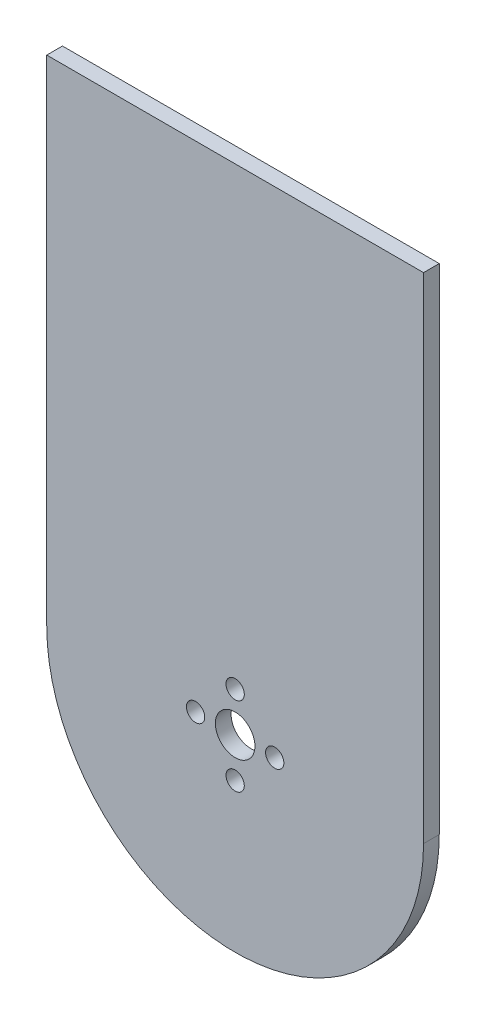
ISO-10303-21;
HEADER;
FILE_DESCRIPTION(('STEP AP214'),'2;1');
FILE_NAME('part.step','',(''),(''),'','','');
FILE_SCHEMA(('AUTOMOTIVE_DESIGN { 1 0 10303 214 1 1 1 1 }'));
ENDSEC;
DATA;
#1=APPLICATION_CONTEXT('core data for automotive mechanical design processes');
#2=APPLICATION_PROTOCOL_DEFINITION('international standard','automotive_design',2000,#1);
#3=PRODUCT_CONTEXT('',#1,'mechanical');
#4=PRODUCT('Part','Part','',(#3));
#5=PRODUCT_RELATED_PRODUCT_CATEGORY('part','',(#4));
#6=PRODUCT_DEFINITION_FORMATION('','',#4);
#7=PRODUCT_DEFINITION_CONTEXT('part definition',#1,'design');
#8=PRODUCT_DEFINITION('design','',#6,#7);
#9=PRODUCT_DEFINITION_SHAPE('','',#8);
#10=(LENGTH_UNIT() NAMED_UNIT(*) SI_UNIT(.MILLI.,.METRE.));
#11=(NAMED_UNIT(*) PLANE_ANGLE_UNIT() SI_UNIT($,.RADIAN.));
#12=(NAMED_UNIT(*) SI_UNIT($,.STERADIAN.) SOLID_ANGLE_UNIT());
#13=UNCERTAINTY_MEASURE_WITH_UNIT(LENGTH_MEASURE(1.E-05),#10,'distance_accuracy_value','');
#14=(GEOMETRIC_REPRESENTATION_CONTEXT(3) GLOBAL_UNCERTAINTY_ASSIGNED_CONTEXT((#13)) GLOBAL_UNIT_ASSIGNED_CONTEXT((#10,
#11,#12)) REPRESENTATION_CONTEXT('',''));
#15=CARTESIAN_POINT('',(0.,0.,0.));
#16=DIRECTION('',(0.,0.,1.));
#17=DIRECTION('',(1.,0.,0.));
#18=AXIS2_PLACEMENT_3D('',#15,#16,#17);
#19=CARTESIAN_POINT('',(0.,0.,3.175));
#20=DIRECTION('',(0.,0.,1.));
#21=DIRECTION('',(1.,0.,0.));
#22=AXIS2_PLACEMENT_3D('',#19,#20,#21);
#23=PLANE('',#22);
#24=CARTESIAN_POINT('',(0.,8.,3.175));
#25=DIRECTION('',(0.,0.,1.));
#26=DIRECTION('',(1.,0.,0.));
#27=AXIS2_PLACEMENT_3D('',#24,#25,#26);
#28=CIRCLE('',#27,1.85);
#29=CARTESIAN_POINT('',(1.85,8.,3.175));
#30=VERTEX_POINT('',#29);
#31=EDGE_CURVE('E127',#30,#30,#28,.T.);
#32=ORIENTED_EDGE('',*,*,#31,.F.);
#33=EDGE_LOOP('',(#32));
#34=FACE_BOUND('',#33,.T.);
#35=CARTESIAN_POINT('',(-8.,0.,3.175));
#36=DIRECTION('',(0.,0.,1.));
#37=DIRECTION('',(1.,0.,0.));
#38=AXIS2_PLACEMENT_3D('',#35,#36,#37);
#39=CIRCLE('',#38,1.85);
#40=CARTESIAN_POINT('',(-6.15,0.,3.175));
#41=VERTEX_POINT('',#40);
#42=EDGE_CURVE('E115',#41,#41,#39,.T.);
#43=ORIENTED_EDGE('',*,*,#42,.F.);
#44=EDGE_LOOP('',(#43));
#45=FACE_BOUND('',#44,.T.);
#46=DIRECTION('',(0.,-1.,0.));
#47=VECTOR('',#46,1.);
#48=CARTESIAN_POINT('',(-38.1,100.,3.175));
#49=LINE('',#48,#47);
#50=CARTESIAN_POINT('',(-38.1,100.,3.175));
#51=VERTEX_POINT('',#50);
#52=CARTESIAN_POINT('',(-38.1,0.,3.175));
#53=VERTEX_POINT('',#52);
#54=EDGE_CURVE('E85',#51,#53,#49,.T.);
#55=ORIENTED_EDGE('',*,*,#54,.T.);
#56=CARTESIAN_POINT('',(0.,0.,3.175));
#57=DIRECTION('',(0.,0.,1.));
#58=DIRECTION('',(1.,0.,0.));
#59=AXIS2_PLACEMENT_3D('',#56,#57,#58);
#60=CIRCLE('',#59,38.1);
#61=CARTESIAN_POINT('',(38.1,0.,3.175));
#62=VERTEX_POINT('',#61);
#63=EDGE_CURVE('E80',#53,#62,#60,.T.);
#64=ORIENTED_EDGE('',*,*,#63,.T.);
#65=DIRECTION('',(0.,1.,0.));
#66=VECTOR('',#65,1.);
#67=CARTESIAN_POINT('',(38.1,100.,3.175));
#68=LINE('',#67,#66);
#69=CARTESIAN_POINT('',(38.1,100.,3.175));
#70=VERTEX_POINT('',#69);
#71=EDGE_CURVE('E83',#62,#70,#68,.T.);
#72=ORIENTED_EDGE('',*,*,#71,.T.);
#73=DIRECTION('',(-1.,0.,0.));
#74=VECTOR('',#73,1.);
#75=CARTESIAN_POINT('',(-38.1,100.,3.175));
#76=LINE('',#75,#74);
#77=EDGE_CURVE('E50',#70,#51,#76,.T.);
#78=ORIENTED_EDGE('',*,*,#77,.T.);
#79=EDGE_LOOP('',(#55,#64,#72,#78));
#80=FACE_BOUND('',#79,.T.);
#81=CARTESIAN_POINT('',(0.,0.,3.175));
#82=DIRECTION('',(0.,0.,1.));
#83=DIRECTION('',(1.,0.,0.));
#84=AXIS2_PLACEMENT_3D('',#81,#82,#83);
#85=CIRCLE('',#84,4.);
#86=CARTESIAN_POINT('',(4.00000000000001,0.,3.175));
#87=VERTEX_POINT('',#86);
#88=EDGE_CURVE('E100',#87,#87,#85,.T.);
#89=ORIENTED_EDGE('',*,*,#88,.F.);
#90=EDGE_LOOP('',(#89));
#91=FACE_BOUND('',#90,.T.);
#92=CARTESIAN_POINT('',(0.,-8.,3.175));
#93=DIRECTION('',(0.,0.,1.));
#94=DIRECTION('',(1.,0.,0.));
#95=AXIS2_PLACEMENT_3D('',#92,#93,#94);
#96=CIRCLE('',#95,1.85);
#97=CARTESIAN_POINT('',(1.85,-8.,3.175));
#98=VERTEX_POINT('',#97);
#99=EDGE_CURVE('E121',#98,#98,#96,.T.);
#100=ORIENTED_EDGE('',*,*,#99,.F.);
#101=EDGE_LOOP('',(#100));
#102=FACE_BOUND('',#101,.T.);
#103=CARTESIAN_POINT('',(8.,0.,3.175));
#104=DIRECTION('',(0.,0.,1.));
#105=DIRECTION('',(1.,0.,0.));
#106=AXIS2_PLACEMENT_3D('',#103,#104,#105);
#107=CIRCLE('',#106,1.85);
#108=CARTESIAN_POINT('',(9.85,0.,3.175));
#109=VERTEX_POINT('',#108);
#110=EDGE_CURVE('E133',#109,#109,#107,.T.);
#111=ORIENTED_EDGE('',*,*,#110,.F.);
#112=EDGE_LOOP('',(#111));
#113=FACE_BOUND('',#112,.T.);
#114=ADVANCED_FACE('F33',(#34,#45,#80,#91,#102,#113),#23,.T.);
#115=CARTESIAN_POINT('',(0.,0.,0.));
#116=DIRECTION('',(0.,0.,1.));
#117=DIRECTION('',(1.,0.,0.));
#118=AXIS2_PLACEMENT_3D('',#115,#116,#117);
#119=PLANE('',#118);
#120=DIRECTION('',(0.,-1.,0.));
#121=VECTOR('',#120,1.);
#122=CARTESIAN_POINT('',(-38.1,100.,0.));
#123=LINE('',#122,#121);
#124=CARTESIAN_POINT('',(-38.1,100.,0.));
#125=VERTEX_POINT('',#124);
#126=CARTESIAN_POINT('',(-38.1,0.,0.));
#127=VERTEX_POINT('',#126);
#128=EDGE_CURVE('E97',#125,#127,#123,.T.);
#129=ORIENTED_EDGE('',*,*,#128,.F.);
#130=DIRECTION('',(-1.,0.,0.));
#131=VECTOR('',#130,1.);
#132=CARTESIAN_POINT('',(-38.1,100.,0.));
#133=LINE('',#132,#131);
#134=CARTESIAN_POINT('',(38.1,100.,0.));
#135=VERTEX_POINT('',#134);
#136=EDGE_CURVE('E73',#135,#125,#133,.T.);
#137=ORIENTED_EDGE('',*,*,#136,.F.);
#138=DIRECTION('',(0.,1.,0.));
#139=VECTOR('',#138,1.);
#140=CARTESIAN_POINT('',(38.1,100.,0.));
#141=LINE('',#140,#139);
#142=CARTESIAN_POINT('',(38.1,0.,0.));
#143=VERTEX_POINT('',#142);
#144=EDGE_CURVE('E67',#143,#135,#141,.T.);
#145=ORIENTED_EDGE('',*,*,#144,.F.);
#146=CARTESIAN_POINT('',(0.,0.,0.));
#147=DIRECTION('',(0.,0.,1.));
#148=DIRECTION('',(1.,0.,0.));
#149=AXIS2_PLACEMENT_3D('',#146,#147,#148);
#150=CIRCLE('',#149,38.1);
#151=EDGE_CURVE('E89',#127,#143,#150,.T.);
#152=ORIENTED_EDGE('',*,*,#151,.F.);
#153=EDGE_LOOP('',(#129,#137,#145,#152));
#154=FACE_BOUND('',#153,.T.);
#155=CARTESIAN_POINT('',(0.,0.,0.));
#156=DIRECTION('',(0.,0.,1.));
#157=DIRECTION('',(1.,0.,0.));
#158=AXIS2_PLACEMENT_3D('',#155,#156,#157);
#159=CIRCLE('',#158,4.);
#160=CARTESIAN_POINT('',(4.00000000000001,0.,0.));
#161=VERTEX_POINT('',#160);
#162=EDGE_CURVE('E112',#161,#161,#159,.T.);
#163=ORIENTED_EDGE('',*,*,#162,.T.);
#164=EDGE_LOOP('',(#163));
#165=FACE_BOUND('',#164,.T.);
#166=CARTESIAN_POINT('',(-8.,0.,0.));
#167=DIRECTION('',(0.,0.,1.));
#168=DIRECTION('',(1.,0.,0.));
#169=AXIS2_PLACEMENT_3D('',#166,#167,#168);
#170=CIRCLE('',#169,1.85);
#171=CARTESIAN_POINT('',(-6.15,0.,0.));
#172=VERTEX_POINT('',#171);
#173=EDGE_CURVE('E118',#172,#172,#170,.T.);
#174=ORIENTED_EDGE('',*,*,#173,.T.);
#175=EDGE_LOOP('',(#174));
#176=FACE_BOUND('',#175,.T.);
#177=CARTESIAN_POINT('',(0.,-8.,0.));
#178=DIRECTION('',(0.,0.,1.));
#179=DIRECTION('',(1.,0.,0.));
#180=AXIS2_PLACEMENT_3D('',#177,#178,#179);
#181=CIRCLE('',#180,1.85);
#182=CARTESIAN_POINT('',(1.85,-8.,0.));
#183=VERTEX_POINT('',#182);
#184=EDGE_CURVE('E124',#183,#183,#181,.T.);
#185=ORIENTED_EDGE('',*,*,#184,.T.);
#186=EDGE_LOOP('',(#185));
#187=FACE_BOUND('',#186,.T.);
#188=CARTESIAN_POINT('',(0.,8.,0.));
#189=DIRECTION('',(0.,0.,1.));
#190=DIRECTION('',(1.,0.,0.));
#191=AXIS2_PLACEMENT_3D('',#188,#189,#190);
#192=CIRCLE('',#191,1.85);
#193=CARTESIAN_POINT('',(1.85,8.,0.));
#194=VERTEX_POINT('',#193);
#195=EDGE_CURVE('E130',#194,#194,#192,.T.);
#196=ORIENTED_EDGE('',*,*,#195,.T.);
#197=EDGE_LOOP('',(#196));
#198=FACE_BOUND('',#197,.T.);
#199=CARTESIAN_POINT('',(8.,0.,0.));
#200=DIRECTION('',(0.,0.,1.));
#201=DIRECTION('',(1.,0.,0.));
#202=AXIS2_PLACEMENT_3D('',#199,#200,#201);
#203=CIRCLE('',#202,1.85);
#204=CARTESIAN_POINT('',(9.85,0.,0.));
#205=VERTEX_POINT('',#204);
#206=EDGE_CURVE('E136',#205,#205,#203,.T.);
#207=ORIENTED_EDGE('',*,*,#206,.T.);
#208=EDGE_LOOP('',(#207));
#209=FACE_BOUND('',#208,.T.);
#210=ADVANCED_FACE('F108',(#154,#165,#176,#187,#198,#209),#119,.F.);
#211=CARTESIAN_POINT('',(-38.1,100.,3.175));
#212=DIRECTION('',(1.,0.,0.));
#213=DIRECTION('',(0.,1.,0.));
#214=AXIS2_PLACEMENT_3D('',#211,#212,#213);
#215=PLANE('',#214);
#216=ORIENTED_EDGE('',*,*,#128,.T.);
#217=DIRECTION('',(0.,0.,-1.));
#218=VECTOR('',#217,1.);
#219=CARTESIAN_POINT('',(-38.1,0.,3.175));
#220=LINE('',#219,#218);
#221=EDGE_CURVE('E11',#53,#127,#220,.T.);
#222=ORIENTED_EDGE('',*,*,#221,.F.);
#223=ORIENTED_EDGE('',*,*,#54,.F.);
#224=DIRECTION('',(0.,0.,-1.));
#225=VECTOR('',#224,1.);
#226=CARTESIAN_POINT('',(-38.1,100.,3.175));
#227=LINE('',#226,#225);
#228=EDGE_CURVE('E93',#51,#125,#227,.T.);
#229=ORIENTED_EDGE('',*,*,#228,.T.);
#230=EDGE_LOOP('',(#216,#222,#223,#229));
#231=FACE_BOUND('',#230,.T.);
#232=ADVANCED_FACE('F35',(#231),#215,.F.);
#233=CARTESIAN_POINT('',(0.,0.,3.175));
#234=DIRECTION('',(0.,0.,-1.));
#235=DIRECTION('',(-1.,0.,0.));
#236=AXIS2_PLACEMENT_3D('',#233,#234,#235);
#237=CYLINDRICAL_SURFACE('',#236,38.1);
#238=ORIENTED_EDGE('',*,*,#151,.T.);
#239=DIRECTION('',(0.,0.,-1.));
#240=VECTOR('',#239,1.);
#241=CARTESIAN_POINT('',(38.1,0.,3.175));
#242=LINE('',#241,#240);
#243=EDGE_CURVE('E42',#62,#143,#242,.T.);
#244=ORIENTED_EDGE('',*,*,#243,.F.);
#245=ORIENTED_EDGE('',*,*,#63,.F.);
#246=ORIENTED_EDGE('',*,*,#221,.T.);
#247=EDGE_LOOP('',(#238,#244,#245,#246));
#248=FACE_BOUND('',#247,.T.);
#249=ADVANCED_FACE('F88',(#248),#237,.T.);
#250=CARTESIAN_POINT('',(38.1,100.,3.175));
#251=DIRECTION('',(-1.,0.,0.));
#252=DIRECTION('',(0.,-1.,0.));
#253=AXIS2_PLACEMENT_3D('',#250,#251,#252);
#254=PLANE('',#253);
#255=ORIENTED_EDGE('',*,*,#144,.T.);
#256=DIRECTION('',(0.,0.,-1.));
#257=VECTOR('',#256,1.);
#258=CARTESIAN_POINT('',(38.1,100.,3.175));
#259=LINE('',#258,#257);
#260=EDGE_CURVE('E90',#70,#135,#259,.T.);
#261=ORIENTED_EDGE('',*,*,#260,.F.);
#262=ORIENTED_EDGE('',*,*,#71,.F.);
#263=ORIENTED_EDGE('',*,*,#243,.T.);
#264=EDGE_LOOP('',(#255,#261,#262,#263));
#265=FACE_BOUND('',#264,.T.);
#266=ADVANCED_FACE('F91',(#265),#254,.F.);
#267=CARTESIAN_POINT('',(-38.1,100.,3.175));
#268=DIRECTION('',(0.,-1.,0.));
#269=DIRECTION('',(0.,0.,-1.));
#270=AXIS2_PLACEMENT_3D('',#267,#268,#269);
#271=PLANE('',#270);
#272=ORIENTED_EDGE('',*,*,#136,.T.);
#273=ORIENTED_EDGE('',*,*,#228,.F.);
#274=ORIENTED_EDGE('',*,*,#77,.F.);
#275=ORIENTED_EDGE('',*,*,#260,.T.);
#276=EDGE_LOOP('',(#272,#273,#274,#275));
#277=FACE_BOUND('',#276,.T.);
#278=ADVANCED_FACE('F105',(#277),#271,.F.);
#279=CARTESIAN_POINT('',(0.,0.,3.175));
#280=DIRECTION('',(0.,0.,-1.));
#281=DIRECTION('',(-1.,0.,0.));
#282=AXIS2_PLACEMENT_3D('',#279,#280,#281);
#283=CYLINDRICAL_SURFACE('',#282,4.);
#284=ORIENTED_EDGE('',*,*,#88,.T.);
#285=EDGE_LOOP('',(#284));
#286=FACE_BOUND('',#285,.T.);
#287=ORIENTED_EDGE('',*,*,#162,.F.);
#288=EDGE_LOOP('',(#287));
#289=FACE_BOUND('',#288,.T.);
#290=ADVANCED_FACE('F155',(#286,#289),#283,.F.);
#291=CARTESIAN_POINT('',(-8.,0.,3.175));
#292=DIRECTION('',(0.,0.,-1.));
#293=DIRECTION('',(-1.,0.,0.));
#294=AXIS2_PLACEMENT_3D('',#291,#292,#293);
#295=CYLINDRICAL_SURFACE('',#294,1.85);
#296=ORIENTED_EDGE('',*,*,#42,.T.);
#297=EDGE_LOOP('',(#296));
#298=FACE_BOUND('',#297,.T.);
#299=ORIENTED_EDGE('',*,*,#173,.F.);
#300=EDGE_LOOP('',(#299));
#301=FACE_BOUND('',#300,.T.);
#302=ADVANCED_FACE('F201',(#298,#301),#295,.F.);
#303=CARTESIAN_POINT('',(0.,-8.,3.175));
#304=DIRECTION('',(0.,0.,-1.));
#305=DIRECTION('',(-1.,0.,0.));
#306=AXIS2_PLACEMENT_3D('',#303,#304,#305);
#307=CYLINDRICAL_SURFACE('',#306,1.85);
#308=ORIENTED_EDGE('',*,*,#99,.T.);
#309=EDGE_LOOP('',(#308));
#310=FACE_BOUND('',#309,.T.);
#311=ORIENTED_EDGE('',*,*,#184,.F.);
#312=EDGE_LOOP('',(#311));
#313=FACE_BOUND('',#312,.T.);
#314=ADVANCED_FACE('F209',(#310,#313),#307,.F.);
#315=CARTESIAN_POINT('',(0.,8.,3.175));
#316=DIRECTION('',(0.,0.,-1.));
#317=DIRECTION('',(-1.,0.,0.));
#318=AXIS2_PLACEMENT_3D('',#315,#316,#317);
#319=CYLINDRICAL_SURFACE('',#318,1.85);
#320=ORIENTED_EDGE('',*,*,#31,.T.);
#321=EDGE_LOOP('',(#320));
#322=FACE_BOUND('',#321,.T.);
#323=ORIENTED_EDGE('',*,*,#195,.F.);
#324=EDGE_LOOP('',(#323));
#325=FACE_BOUND('',#324,.T.);
#326=ADVANCED_FACE('F217',(#322,#325),#319,.F.);
#327=CARTESIAN_POINT('',(8.,0.,3.175));
#328=DIRECTION('',(0.,0.,-1.));
#329=DIRECTION('',(-1.,0.,0.));
#330=AXIS2_PLACEMENT_3D('',#327,#328,#329);
#331=CYLINDRICAL_SURFACE('',#330,1.85);
#332=ORIENTED_EDGE('',*,*,#110,.T.);
#333=EDGE_LOOP('',(#332));
#334=FACE_BOUND('',#333,.T.);
#335=ORIENTED_EDGE('',*,*,#206,.F.);
#336=EDGE_LOOP('',(#335));
#337=FACE_BOUND('',#336,.T.);
#338=ADVANCED_FACE('F142',(#334,#337),#331,.F.);
#339=CLOSED_SHELL('',(#114,#210,#232,#249,#266,#278,#290,#302,#314,#326,#338));
#340=MANIFOLD_SOLID_BREP('B2',#339);
#341=ADVANCED_BREP_SHAPE_REPRESENTATION('',(#18,#340),#14);
#342=SHAPE_DEFINITION_REPRESENTATION(#9,#341);
ENDSEC;
END-ISO-10303-21;
